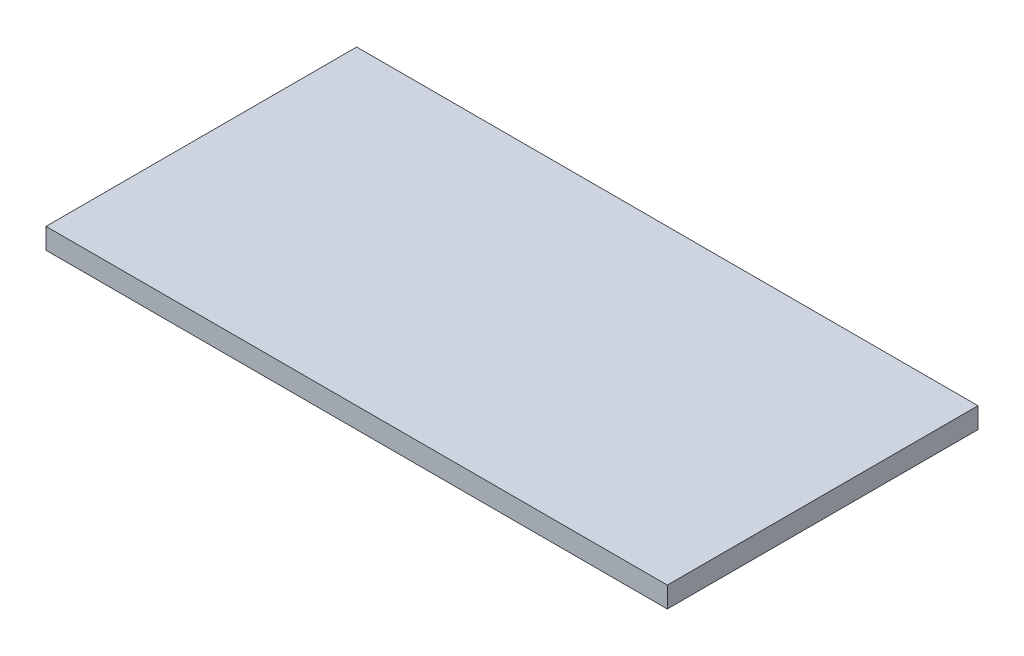
ISO-10303-21;
HEADER;
FILE_DESCRIPTION(('STEP AP214'),'2;1');
FILE_NAME('part.step','',(''),(''),'','','');
FILE_SCHEMA(('AUTOMOTIVE_DESIGN { 1 0 10303 214 1 1 1 1 }'));
ENDSEC;
DATA;
#1=APPLICATION_CONTEXT('core data for automotive mechanical design processes');
#2=APPLICATION_PROTOCOL_DEFINITION('international standard','automotive_design',2000,#1);
#3=PRODUCT_CONTEXT('',#1,'mechanical');
#4=PRODUCT('Part','Part','',(#3));
#5=PRODUCT_RELATED_PRODUCT_CATEGORY('part','',(#4));
#6=PRODUCT_DEFINITION_FORMATION('','',#4);
#7=PRODUCT_DEFINITION_CONTEXT('part definition',#1,'design');
#8=PRODUCT_DEFINITION('design','',#6,#7);
#9=PRODUCT_DEFINITION_SHAPE('','',#8);
#10=(LENGTH_UNIT() NAMED_UNIT(*) SI_UNIT(.MILLI.,.METRE.));
#11=(NAMED_UNIT(*) PLANE_ANGLE_UNIT() SI_UNIT($,.RADIAN.));
#12=(NAMED_UNIT(*) SI_UNIT($,.STERADIAN.) SOLID_ANGLE_UNIT());
#13=UNCERTAINTY_MEASURE_WITH_UNIT(LENGTH_MEASURE(1.E-05),#10,'distance_accuracy_value','');
#14=(GEOMETRIC_REPRESENTATION_CONTEXT(3) GLOBAL_UNCERTAINTY_ASSIGNED_CONTEXT((#13)) GLOBAL_UNIT_ASSIGNED_CONTEXT((#10,
#11,#12)) REPRESENTATION_CONTEXT('',''));
#15=CARTESIAN_POINT('',(0.,0.,0.));
#16=DIRECTION('',(0.,0.,1.));
#17=DIRECTION('',(1.,0.,0.));
#18=AXIS2_PLACEMENT_3D('',#15,#16,#17);
#19=CARTESIAN_POINT('',(-13.3,1.,-6.59999999999999));
#20=DIRECTION('',(1.,0.,0.));
#21=DIRECTION('',(0.,0.,-1.));
#22=AXIS2_PLACEMENT_3D('',#19,#20,#21);
#23=PLANE('',#22);
#24=DIRECTION('',(0.,0.,1.));
#25=VECTOR('',#24,1.);
#26=CARTESIAN_POINT('',(-13.3,0.,-6.59999999999999));
#27=LINE('',#26,#25);
#28=CARTESIAN_POINT('',(-13.3,0.,-6.59999999999999));
#29=VERTEX_POINT('',#28);
#30=CARTESIAN_POINT('',(-13.3,0.,8.4));
#31=VERTEX_POINT('',#30);
#32=EDGE_CURVE('E95',#29,#31,#27,.T.);
#33=ORIENTED_EDGE('',*,*,#32,.T.);
#34=DIRECTION('',(0.,-1.,0.));
#35=VECTOR('',#34,1.);
#36=CARTESIAN_POINT('',(-13.3,1.,8.4));
#37=LINE('',#36,#35);
#38=CARTESIAN_POINT('',(-13.3,1.,8.4));
#39=VERTEX_POINT('',#38);
#40=EDGE_CURVE('E11',#39,#31,#37,.T.);
#41=ORIENTED_EDGE('',*,*,#40,.F.);
#42=DIRECTION('',(0.,0.,1.));
#43=VECTOR('',#42,1.);
#44=CARTESIAN_POINT('',(-13.3,1.,-6.59999999999999));
#45=LINE('',#44,#43);
#46=CARTESIAN_POINT('',(-13.3,1.,-6.59999999999999));
#47=VERTEX_POINT('',#46);
#48=EDGE_CURVE('E83',#47,#39,#45,.T.);
#49=ORIENTED_EDGE('',*,*,#48,.F.);
#50=DIRECTION('',(0.,-1.,0.));
#51=VECTOR('',#50,1.);
#52=CARTESIAN_POINT('',(-13.3,1.,-6.59999999999999));
#53=LINE('',#52,#51);
#54=EDGE_CURVE('E91',#47,#29,#53,.T.);
#55=ORIENTED_EDGE('',*,*,#54,.T.);
#56=EDGE_LOOP('',(#33,#41,#49,#55));
#57=FACE_BOUND('',#56,.T.);
#58=ADVANCED_FACE('F32',(#57),#23,.F.);
#59=CARTESIAN_POINT('',(-13.3,1.,8.4));
#60=DIRECTION('',(0.,0.,-1.));
#61=DIRECTION('',(-1.,0.,0.));
#62=AXIS2_PLACEMENT_3D('',#59,#60,#61);
#63=PLANE('',#62);
#64=DIRECTION('',(1.,0.,0.));
#65=VECTOR('',#64,1.);
#66=CARTESIAN_POINT('',(-13.3,0.,8.4));
#67=LINE('',#66,#65);
#68=CARTESIAN_POINT('',(16.7,0.,8.4));
#69=VERTEX_POINT('',#68);
#70=EDGE_CURVE('E87',#31,#69,#67,.T.);
#71=ORIENTED_EDGE('',*,*,#70,.T.);
#72=DIRECTION('',(0.,-1.,0.));
#73=VECTOR('',#72,1.);
#74=CARTESIAN_POINT('',(16.7,1.,8.4));
#75=LINE('',#74,#73);
#76=CARTESIAN_POINT('',(16.7,1.,8.4));
#77=VERTEX_POINT('',#76);
#78=EDGE_CURVE('E40',#77,#69,#75,.T.);
#79=ORIENTED_EDGE('',*,*,#78,.F.);
#80=DIRECTION('',(1.,0.,0.));
#81=VECTOR('',#80,1.);
#82=CARTESIAN_POINT('',(-13.3,1.,8.4));
#83=LINE('',#82,#81);
#84=EDGE_CURVE('E78',#39,#77,#83,.T.);
#85=ORIENTED_EDGE('',*,*,#84,.F.);
#86=ORIENTED_EDGE('',*,*,#40,.T.);
#87=EDGE_LOOP('',(#71,#79,#85,#86));
#88=FACE_BOUND('',#87,.T.);
#89=ADVANCED_FACE('F86',(#88),#63,.F.);
#90=CARTESIAN_POINT('',(16.7,1.,-6.59999999999999));
#91=DIRECTION('',(-1.,0.,0.));
#92=DIRECTION('',(0.,0.,1.));
#93=AXIS2_PLACEMENT_3D('',#90,#91,#92);
#94=PLANE('',#93);
#95=DIRECTION('',(0.,0.,-1.));
#96=VECTOR('',#95,1.);
#97=CARTESIAN_POINT('',(16.7,0.,-6.59999999999999));
#98=LINE('',#97,#96);
#99=CARTESIAN_POINT('',(16.7,0.,-6.59999999999999));
#100=VERTEX_POINT('',#99);
#101=EDGE_CURVE('E65',#69,#100,#98,.T.);
#102=ORIENTED_EDGE('',*,*,#101,.T.);
#103=DIRECTION('',(0.,-1.,0.));
#104=VECTOR('',#103,1.);
#105=CARTESIAN_POINT('',(16.7,1.,-6.59999999999999));
#106=LINE('',#105,#104);
#107=CARTESIAN_POINT('',(16.7,1.,-6.59999999999999));
#108=VERTEX_POINT('',#107);
#109=EDGE_CURVE('E88',#108,#100,#106,.T.);
#110=ORIENTED_EDGE('',*,*,#109,.F.);
#111=DIRECTION('',(0.,0.,-1.));
#112=VECTOR('',#111,1.);
#113=CARTESIAN_POINT('',(16.7,1.,-6.59999999999999));
#114=LINE('',#113,#112);
#115=EDGE_CURVE('E81',#77,#108,#114,.T.);
#116=ORIENTED_EDGE('',*,*,#115,.F.);
#117=ORIENTED_EDGE('',*,*,#78,.T.);
#118=EDGE_LOOP('',(#102,#110,#116,#117));
#119=FACE_BOUND('',#118,.T.);
#120=ADVANCED_FACE('F89',(#119),#94,.F.);
#121=CARTESIAN_POINT('',(-13.3,1.,-6.59999999999999));
#122=DIRECTION('',(0.,0.,1.));
#123=DIRECTION('',(1.,0.,0.));
#124=AXIS2_PLACEMENT_3D('',#121,#122,#123);
#125=PLANE('',#124);
#126=DIRECTION('',(-1.,0.,0.));
#127=VECTOR('',#126,1.);
#128=CARTESIAN_POINT('',(-13.3,0.,-6.59999999999999));
#129=LINE('',#128,#127);
#130=EDGE_CURVE('E71',#100,#29,#129,.T.);
#131=ORIENTED_EDGE('',*,*,#130,.T.);
#132=ORIENTED_EDGE('',*,*,#54,.F.);
#133=DIRECTION('',(-1.,0.,0.));
#134=VECTOR('',#133,1.);
#135=CARTESIAN_POINT('',(-13.3,1.,-6.59999999999999));
#136=LINE('',#135,#134);
#137=EDGE_CURVE('E48',#108,#47,#136,.T.);
#138=ORIENTED_EDGE('',*,*,#137,.F.);
#139=ORIENTED_EDGE('',*,*,#109,.T.);
#140=EDGE_LOOP('',(#131,#132,#138,#139));
#141=FACE_BOUND('',#140,.T.);
#142=ADVANCED_FACE('F102',(#141),#125,.F.);
#143=CARTESIAN_POINT('',(0.,1.,0.));
#144=DIRECTION('',(0.,1.,0.));
#145=DIRECTION('',(0.,0.,1.));
#146=AXIS2_PLACEMENT_3D('',#143,#144,#145);
#147=PLANE('',#146);
#148=ORIENTED_EDGE('',*,*,#48,.T.);
#149=ORIENTED_EDGE('',*,*,#84,.T.);
#150=ORIENTED_EDGE('',*,*,#115,.T.);
#151=ORIENTED_EDGE('',*,*,#137,.T.);
#152=EDGE_LOOP('',(#148,#149,#150,#151));
#153=FACE_BOUND('',#152,.T.);
#154=ADVANCED_FACE('F79',(#153),#147,.T.);
#155=CARTESIAN_POINT('',(0.,0.,0.));
#156=DIRECTION('',(0.,1.,0.));
#157=DIRECTION('',(0.,0.,1.));
#158=AXIS2_PLACEMENT_3D('',#155,#156,#157);
#159=PLANE('',#158);
#160=ORIENTED_EDGE('',*,*,#32,.F.);
#161=ORIENTED_EDGE('',*,*,#130,.F.);
#162=ORIENTED_EDGE('',*,*,#101,.F.);
#163=ORIENTED_EDGE('',*,*,#70,.F.);
#164=EDGE_LOOP('',(#160,#161,#162,#163));
#165=FACE_BOUND('',#164,.T.);
#166=ADVANCED_FACE('F105',(#165),#159,.F.);
#167=CLOSED_SHELL('',(#58,#89,#120,#142,#154,#166));
#168=MANIFOLD_SOLID_BREP('B2',#167);
#169=ADVANCED_BREP_SHAPE_REPRESENTATION('',(#18,#168),#14);
#170=SHAPE_DEFINITION_REPRESENTATION(#9,#169);
ENDSEC;
END-ISO-10303-21;
